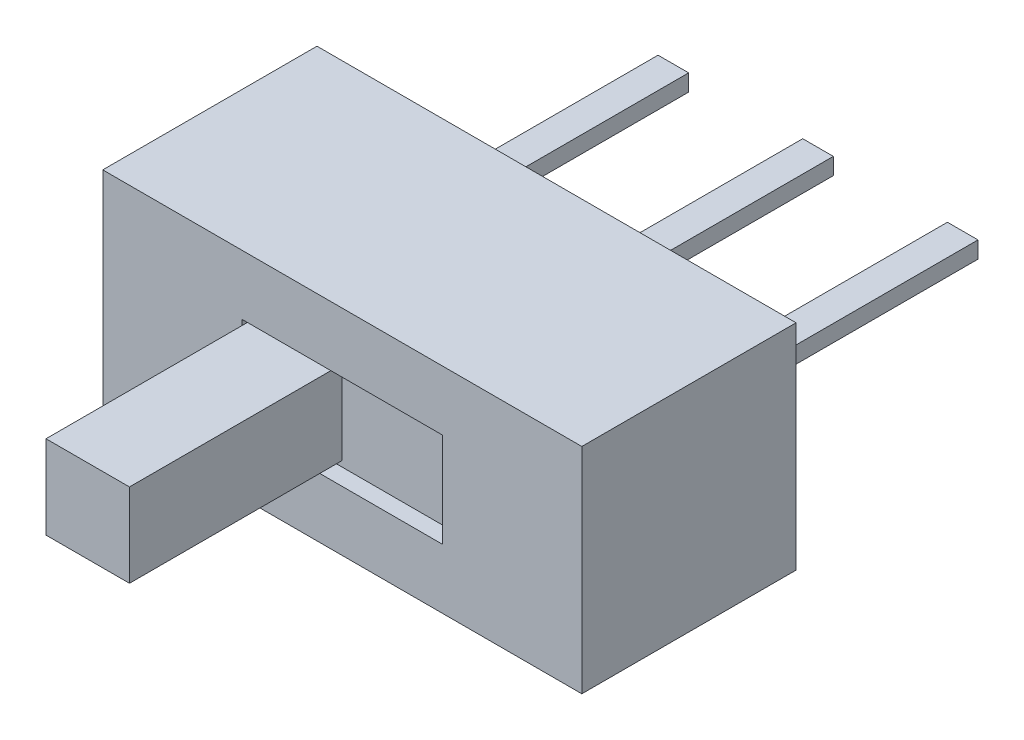
ISO-10303-21;
HEADER;
FILE_DESCRIPTION(('STEP AP214'),'2;1');
FILE_NAME('part.step','',(''),(''),'','','');
FILE_SCHEMA(('AUTOMOTIVE_DESIGN { 1 0 10303 214 1 1 1 1 }'));
ENDSEC;
DATA;
#1=APPLICATION_CONTEXT('core data for automotive mechanical design processes');
#2=APPLICATION_PROTOCOL_DEFINITION('international standard','automotive_design',2000,#1);
#3=PRODUCT_CONTEXT('',#1,'mechanical');
#4=PRODUCT('Part','Part','',(#3));
#5=PRODUCT_RELATED_PRODUCT_CATEGORY('part','',(#4));
#6=PRODUCT_DEFINITION_FORMATION('','',#4);
#7=PRODUCT_DEFINITION_CONTEXT('part definition',#1,'design');
#8=PRODUCT_DEFINITION('design','',#6,#7);
#9=PRODUCT_DEFINITION_SHAPE('','',#8);
#10=(LENGTH_UNIT() NAMED_UNIT(*) SI_UNIT(.MILLI.,.METRE.));
#11=(NAMED_UNIT(*) PLANE_ANGLE_UNIT() SI_UNIT($,.RADIAN.));
#12=(NAMED_UNIT(*) SI_UNIT($,.STERADIAN.) SOLID_ANGLE_UNIT());
#13=UNCERTAINTY_MEASURE_WITH_UNIT(LENGTH_MEASURE(1.E-05),#10,'distance_accuracy_value','');
#14=(GEOMETRIC_REPRESENTATION_CONTEXT(3) GLOBAL_UNCERTAINTY_ASSIGNED_CONTEXT((#13)) GLOBAL_UNIT_ASSIGNED_CONTEXT((#10,
#11,#12)) REPRESENTATION_CONTEXT('',''));
#15=CARTESIAN_POINT('',(0.,0.,0.));
#16=DIRECTION('',(0.,0.,1.));
#17=DIRECTION('',(1.,0.,0.));
#18=AXIS2_PLACEMENT_3D('',#15,#16,#17);
#19=CARTESIAN_POINT('',(-1.805,1.175,1.625));
#20=DIRECTION('',(0.,-1.,0.));
#21=DIRECTION('',(0.,0.,-1.));
#22=AXIS2_PLACEMENT_3D('',#19,#20,#21);
#23=PLANE('',#22);
#24=DIRECTION('',(0.,0.,1.));
#25=VECTOR('',#24,1.);
#26=CARTESIAN_POINT('',(-1.805,1.175,1.625));
#27=LINE('',#26,#25);
#28=CARTESIAN_POINT('',(-1.805,1.175,1.925));
#29=VERTEX_POINT('',#28);
#30=CARTESIAN_POINT('',(-1.805,1.175,5.445));
#31=VERTEX_POINT('',#30);
#32=EDGE_CURVE('E204',#29,#31,#27,.T.);
#33=ORIENTED_EDGE('',*,*,#32,.F.);
#34=DIRECTION('',(0.,0.,-1.));
#35=VECTOR('',#34,1.);
#36=CARTESIAN_POINT('',(-1.805,1.175,1.625));
#37=LINE('',#36,#35);
#38=CARTESIAN_POINT('',(-1.805,1.175,1.625));
#39=VERTEX_POINT('',#38);
#40=EDGE_CURVE('E183',#29,#39,#37,.T.);
#41=ORIENTED_EDGE('',*,*,#40,.T.);
#42=DIRECTION('',(1.,0.,0.));
#43=VECTOR('',#42,1.);
#44=CARTESIAN_POINT('',(-1.805,1.175,1.625));
#45=LINE('',#44,#43);
#46=CARTESIAN_POINT('',(-0.305,1.175,1.625));
#47=VERTEX_POINT('',#46);
#48=EDGE_CURVE('E20',#39,#47,#45,.T.);
#49=ORIENTED_EDGE('',*,*,#48,.T.);
#50=DIRECTION('',(0.,0.,-1.));
#51=VECTOR('',#50,1.);
#52=CARTESIAN_POINT('',(-0.305,1.175,1.625));
#53=LINE('',#52,#51);
#54=CARTESIAN_POINT('',(-0.305,1.175,5.445));
#55=VERTEX_POINT('',#54);
#56=EDGE_CURVE('E219',#55,#47,#53,.T.);
#57=ORIENTED_EDGE('',*,*,#56,.F.);
#58=DIRECTION('',(1.,0.,0.));
#59=VECTOR('',#58,1.);
#60=CARTESIAN_POINT('',(-1.055,1.175,5.445));
#61=LINE('',#60,#59);
#62=EDGE_CURVE('E213',#31,#55,#61,.T.);
#63=ORIENTED_EDGE('',*,*,#62,.F.);
#64=EDGE_LOOP('',(#33,#41,#49,#57,#63));
#65=FACE_BOUND('',#64,.T.);
#66=ADVANCED_FACE('F17',(#65),#23,.T.);
#67=CARTESIAN_POINT('',(-1.805,2.675,1.625));
#68=DIRECTION('',(-1.,0.,0.));
#69=DIRECTION('',(0.,0.,1.));
#70=AXIS2_PLACEMENT_3D('',#67,#68,#69);
#71=PLANE('',#70);
#72=DIRECTION('',(0.,1.,0.));
#73=VECTOR('',#72,1.);
#74=CARTESIAN_POINT('',(-1.805,1.925,5.445));
#75=LINE('',#74,#73);
#76=CARTESIAN_POINT('',(-1.805,2.675,5.445));
#77=VERTEX_POINT('',#76);
#78=EDGE_CURVE('E210',#77,#31,#75,.F.);
#79=ORIENTED_EDGE('',*,*,#78,.F.);
#80=DIRECTION('',(0.,0.,1.));
#81=VECTOR('',#80,1.);
#82=CARTESIAN_POINT('',(-1.805,2.675,1.625));
#83=LINE('',#82,#81);
#84=CARTESIAN_POINT('',(-1.805,2.675,1.925));
#85=VERTEX_POINT('',#84);
#86=EDGE_CURVE('E233',#85,#77,#83,.T.);
#87=ORIENTED_EDGE('',*,*,#86,.F.);
#88=DIRECTION('',(0.,1.,0.));
#89=VECTOR('',#88,1.);
#90=CARTESIAN_POINT('',(-1.805,2.675,1.925));
#91=LINE('',#90,#89);
#92=EDGE_CURVE('E206',#85,#29,#91,.F.);
#93=ORIENTED_EDGE('',*,*,#92,.T.);
#94=ORIENTED_EDGE('',*,*,#32,.T.);
#95=EDGE_LOOP('',(#79,#87,#93,#94));
#96=FACE_BOUND('',#95,.T.);
#97=ADVANCED_FACE('F513',(#96),#71,.T.);
#98=CARTESIAN_POINT('',(-1.055,1.925,5.445));
#99=DIRECTION('',(0.,0.,1.));
#100=DIRECTION('',(1.,0.,0.));
#101=AXIS2_PLACEMENT_3D('',#98,#99,#100);
#102=PLANE('',#101);
#103=ORIENTED_EDGE('',*,*,#62,.T.);
#104=DIRECTION('',(0.,1.,0.));
#105=VECTOR('',#104,1.);
#106=CARTESIAN_POINT('',(-0.305,1.175,5.445));
#107=LINE('',#106,#105);
#108=CARTESIAN_POINT('',(-0.305,2.675,5.445));
#109=VERTEX_POINT('',#108);
#110=EDGE_CURVE('E216',#109,#55,#107,.F.);
#111=ORIENTED_EDGE('',*,*,#110,.F.);
#112=DIRECTION('',(1.,0.,0.));
#113=VECTOR('',#112,1.);
#114=CARTESIAN_POINT('',(-0.305,2.675,5.445));
#115=LINE('',#114,#113);
#116=EDGE_CURVE('E236',#77,#109,#115,.T.);
#117=ORIENTED_EDGE('',*,*,#116,.F.);
#118=ORIENTED_EDGE('',*,*,#78,.T.);
#119=EDGE_LOOP('',(#103,#111,#117,#118));
#120=FACE_BOUND('',#119,.T.);
#121=ADVANCED_FACE('F510',(#120),#102,.T.);
#122=CARTESIAN_POINT('',(-0.305,1.175,1.625));
#123=DIRECTION('',(1.,0.,0.));
#124=DIRECTION('',(0.,0.,-1.));
#125=AXIS2_PLACEMENT_3D('',#122,#123,#124);
#126=PLANE('',#125);
#127=ORIENTED_EDGE('',*,*,#110,.T.);
#128=ORIENTED_EDGE('',*,*,#56,.T.);
#129=DIRECTION('',(0.,1.,0.));
#130=VECTOR('',#129,1.);
#131=CARTESIAN_POINT('',(-0.305,1.175,1.625));
#132=LINE('',#131,#130);
#133=CARTESIAN_POINT('',(-0.305,2.675,1.625));
#134=VERTEX_POINT('',#133);
#135=EDGE_CURVE('E192',#47,#134,#132,.T.);
#136=ORIENTED_EDGE('',*,*,#135,.T.);
#137=DIRECTION('',(0.,0.,1.));
#138=VECTOR('',#137,1.);
#139=CARTESIAN_POINT('',(-0.305,2.675,1.625));
#140=LINE('',#139,#138);
#141=EDGE_CURVE('E239',#109,#134,#140,.F.);
#142=ORIENTED_EDGE('',*,*,#141,.F.);
#143=EDGE_LOOP('',(#127,#128,#136,#142));
#144=FACE_BOUND('',#143,.T.);
#145=ADVANCED_FACE('F506',(#144),#126,.T.);
#146=CARTESIAN_POINT('',(2.875,2.075,-1.925));
#147=DIRECTION('',(1.,0.,0.));
#148=DIRECTION('',(0.,0.,-1.));
#149=AXIS2_PLACEMENT_3D('',#146,#147,#148);
#150=PLANE('',#149);
#151=DIRECTION('',(0.,1.,0.));
#152=VECTOR('',#151,1.);
#153=CARTESIAN_POINT('',(2.875,1.925,-6.625));
#154=LINE('',#153,#152);
#155=CARTESIAN_POINT('',(2.875,2.075,-6.625));
#156=VERTEX_POINT('',#155);
#157=CARTESIAN_POINT('',(2.875,1.775,-6.625));
#158=VERTEX_POINT('',#157);
#159=EDGE_CURVE('E250',#156,#158,#154,.F.);
#160=ORIENTED_EDGE('',*,*,#159,.F.);
#161=DIRECTION('',(0.,0.,1.));
#162=VECTOR('',#161,1.);
#163=CARTESIAN_POINT('',(2.875,2.075,-1.925));
#164=LINE('',#163,#162);
#165=CARTESIAN_POINT('',(2.875,2.075,-1.925));
#166=VERTEX_POINT('',#165);
#167=EDGE_CURVE('E245',#166,#156,#164,.F.);
#168=ORIENTED_EDGE('',*,*,#167,.F.);
#169=DIRECTION('',(0.,1.,0.));
#170=VECTOR('',#169,1.);
#171=CARTESIAN_POINT('',(2.875,2.075,-1.925));
#172=LINE('',#171,#170);
#173=CARTESIAN_POINT('',(2.875,1.775,-1.925));
#174=VERTEX_POINT('',#173);
#175=EDGE_CURVE('E221',#166,#174,#172,.F.);
#176=ORIENTED_EDGE('',*,*,#175,.T.);
#177=DIRECTION('',(0.,0.,-1.));
#178=VECTOR('',#177,1.);
#179=CARTESIAN_POINT('',(2.875,1.775,-1.925));
#180=LINE('',#179,#178);
#181=EDGE_CURVE('E257',#158,#174,#180,.F.);
#182=ORIENTED_EDGE('',*,*,#181,.F.);
#183=EDGE_LOOP('',(#160,#168,#176,#182));
#184=FACE_BOUND('',#183,.T.);
#185=ADVANCED_FACE('F502',(#184),#150,.T.);
#186=CARTESIAN_POINT('',(-2.325,1.775,-1.925));
#187=DIRECTION('',(0.,-1.,0.));
#188=DIRECTION('',(0.,0.,-1.));
#189=AXIS2_PLACEMENT_3D('',#186,#187,#188);
#190=PLANE('',#189);
#191=DIRECTION('',(-1.,0.,0.));
#192=VECTOR('',#191,1.);
#193=CARTESIAN_POINT('',(-2.6,1.775,-6.625));
#194=LINE('',#193,#192);
#195=CARTESIAN_POINT('',(-2.325,1.775,-6.625));
#196=VERTEX_POINT('',#195);
#197=CARTESIAN_POINT('',(-2.875,1.775,-6.625));
#198=VERTEX_POINT('',#197);
#199=EDGE_CURVE('E268',#196,#198,#194,.T.);
#200=ORIENTED_EDGE('',*,*,#199,.F.);
#201=DIRECTION('',(0.,0.,-1.));
#202=VECTOR('',#201,1.);
#203=CARTESIAN_POINT('',(-2.325,1.775,-1.925));
#204=LINE('',#203,#202);
#205=CARTESIAN_POINT('',(-2.325,1.775,-1.925));
#206=VERTEX_POINT('',#205);
#207=EDGE_CURVE('E263',#206,#196,#204,.T.);
#208=ORIENTED_EDGE('',*,*,#207,.F.);
#209=DIRECTION('',(1.,0.,0.));
#210=VECTOR('',#209,1.);
#211=CARTESIAN_POINT('',(-2.325,1.775,-1.925));
#212=LINE('',#211,#210);
#213=CARTESIAN_POINT('',(-2.875,1.775,-1.925));
#214=VERTEX_POINT('',#213);
#215=EDGE_CURVE('E224',#206,#214,#212,.F.);
#216=ORIENTED_EDGE('',*,*,#215,.T.);
#217=DIRECTION('',(0.,0.,1.));
#218=VECTOR('',#217,1.);
#219=CARTESIAN_POINT('',(-2.875,1.775,-1.925));
#220=LINE('',#219,#218);
#221=EDGE_CURVE('E275',#198,#214,#220,.T.);
#222=ORIENTED_EDGE('',*,*,#221,.F.);
#223=EDGE_LOOP('',(#200,#208,#216,#222));
#224=FACE_BOUND('',#223,.T.);
#225=ADVANCED_FACE('F498',(#224),#190,.T.);
#226=CARTESIAN_POINT('',(0.275,1.775,-1.925));
#227=DIRECTION('',(0.,-1.,0.));
#228=DIRECTION('',(0.,0.,-1.));
#229=AXIS2_PLACEMENT_3D('',#226,#227,#228);
#230=PLANE('',#229);
#231=DIRECTION('',(-1.,0.,0.));
#232=VECTOR('',#231,1.);
#233=CARTESIAN_POINT('',(0.,1.775,-6.625));
#234=LINE('',#233,#232);
#235=CARTESIAN_POINT('',(0.275,1.775,-6.625));
#236=VERTEX_POINT('',#235);
#237=CARTESIAN_POINT('',(-0.275,1.775,-6.625));
#238=VERTEX_POINT('',#237);
#239=EDGE_CURVE('E286',#236,#238,#234,.T.);
#240=ORIENTED_EDGE('',*,*,#239,.F.);
#241=DIRECTION('',(0.,0.,-1.));
#242=VECTOR('',#241,1.);
#243=CARTESIAN_POINT('',(0.275,1.775,-1.925));
#244=LINE('',#243,#242);
#245=CARTESIAN_POINT('',(0.275,1.775,-1.925));
#246=VERTEX_POINT('',#245);
#247=EDGE_CURVE('E281',#246,#236,#244,.T.);
#248=ORIENTED_EDGE('',*,*,#247,.F.);
#249=DIRECTION('',(1.,0.,0.));
#250=VECTOR('',#249,1.);
#251=CARTESIAN_POINT('',(0.275,1.775,-1.925));
#252=LINE('',#251,#250);
#253=CARTESIAN_POINT('',(-0.275,1.775,-1.925));
#254=VERTEX_POINT('',#253);
#255=EDGE_CURVE('E227',#246,#254,#252,.F.);
#256=ORIENTED_EDGE('',*,*,#255,.T.);
#257=DIRECTION('',(0.,0.,1.));
#258=VECTOR('',#257,1.);
#259=CARTESIAN_POINT('',(-0.275,1.775,-1.925));
#260=LINE('',#259,#258);
#261=EDGE_CURVE('E293',#238,#254,#260,.T.);
#262=ORIENTED_EDGE('',*,*,#261,.F.);
#263=EDGE_LOOP('',(#240,#248,#256,#262));
#264=FACE_BOUND('',#263,.T.);
#265=ADVANCED_FACE('F494',(#264),#230,.T.);
#266=CARTESIAN_POINT('',(-0.305,2.675,1.625));
#267=DIRECTION('',(0.,1.,0.));
#268=DIRECTION('',(0.,0.,1.));
#269=AXIS2_PLACEMENT_3D('',#266,#267,#268);
#270=PLANE('',#269);
#271=ORIENTED_EDGE('',*,*,#116,.T.);
#272=ORIENTED_EDGE('',*,*,#141,.T.);
#273=DIRECTION('',(-1.,0.,0.));
#274=VECTOR('',#273,1.);
#275=CARTESIAN_POINT('',(0.,2.675,1.625));
#276=LINE('',#275,#274);
#277=CARTESIAN_POINT('',(-1.805,2.675,1.625));
#278=VERTEX_POINT('',#277);
#279=EDGE_CURVE('E199',#134,#278,#276,.T.);
#280=ORIENTED_EDGE('',*,*,#279,.T.);
#281=DIRECTION('',(0.,0.,1.));
#282=VECTOR('',#281,1.);
#283=CARTESIAN_POINT('',(-1.805,2.675,1.625));
#284=LINE('',#283,#282);
#285=EDGE_CURVE('E230',#278,#85,#284,.T.);
#286=ORIENTED_EDGE('',*,*,#285,.T.);
#287=ORIENTED_EDGE('',*,*,#86,.T.);
#288=EDGE_LOOP('',(#271,#272,#280,#286,#287));
#289=FACE_BOUND('',#288,.T.);
#290=ADVANCED_FACE('F490',(#289),#270,.T.);
#291=CARTESIAN_POINT('',(2.325,2.075,-1.925));
#292=DIRECTION('',(0.,1.,0.));
#293=DIRECTION('',(0.,0.,1.));
#294=AXIS2_PLACEMENT_3D('',#291,#292,#293);
#295=PLANE('',#294);
#296=DIRECTION('',(-1.,0.,0.));
#297=VECTOR('',#296,1.);
#298=CARTESIAN_POINT('',(2.6,2.075,-6.625));
#299=LINE('',#298,#297);
#300=CARTESIAN_POINT('',(2.325,2.075,-6.625));
#301=VERTEX_POINT('',#300);
#302=EDGE_CURVE('E247',#301,#156,#299,.F.);
#303=ORIENTED_EDGE('',*,*,#302,.F.);
#304=DIRECTION('',(0.,0.,1.));
#305=VECTOR('',#304,1.);
#306=CARTESIAN_POINT('',(2.325,2.075,-1.925));
#307=LINE('',#306,#305);
#308=CARTESIAN_POINT('',(2.325,2.075,-1.925));
#309=VERTEX_POINT('',#308);
#310=EDGE_CURVE('E299',#309,#301,#307,.F.);
#311=ORIENTED_EDGE('',*,*,#310,.F.);
#312=DIRECTION('',(1.,0.,0.));
#313=VECTOR('',#312,1.);
#314=CARTESIAN_POINT('',(2.325,2.075,-1.925));
#315=LINE('',#314,#313);
#316=EDGE_CURVE('E242',#309,#166,#315,.T.);
#317=ORIENTED_EDGE('',*,*,#316,.T.);
#318=ORIENTED_EDGE('',*,*,#167,.T.);
#319=EDGE_LOOP('',(#303,#311,#317,#318));
#320=FACE_BOUND('',#319,.T.);
#321=ADVANCED_FACE('F486',(#320),#295,.T.);
#322=CARTESIAN_POINT('',(2.6,1.925,-6.625));
#323=DIRECTION('',(0.,0.,-1.));
#324=DIRECTION('',(-1.,0.,0.));
#325=AXIS2_PLACEMENT_3D('',#322,#323,#324);
#326=PLANE('',#325);
#327=ORIENTED_EDGE('',*,*,#159,.T.);
#328=DIRECTION('',(1.,0.,0.));
#329=VECTOR('',#328,1.);
#330=CARTESIAN_POINT('',(2.875,1.775,-6.625));
#331=LINE('',#330,#329);
#332=CARTESIAN_POINT('',(2.325,1.775,-6.625));
#333=VERTEX_POINT('',#332);
#334=EDGE_CURVE('E254',#333,#158,#331,.T.);
#335=ORIENTED_EDGE('',*,*,#334,.F.);
#336=DIRECTION('',(0.,1.,0.));
#337=VECTOR('',#336,1.);
#338=CARTESIAN_POINT('',(2.325,1.775,-6.625));
#339=LINE('',#338,#337);
#340=EDGE_CURVE('E302',#301,#333,#339,.F.);
#341=ORIENTED_EDGE('',*,*,#340,.F.);
#342=ORIENTED_EDGE('',*,*,#302,.T.);
#343=EDGE_LOOP('',(#327,#335,#341,#342));
#344=FACE_BOUND('',#343,.T.);
#345=ADVANCED_FACE('F482',(#344),#326,.T.);
#346=CARTESIAN_POINT('',(2.875,1.775,-1.925));
#347=DIRECTION('',(0.,-1.,0.));
#348=DIRECTION('',(0.,0.,-1.));
#349=AXIS2_PLACEMENT_3D('',#346,#347,#348);
#350=PLANE('',#349);
#351=ORIENTED_EDGE('',*,*,#334,.T.);
#352=ORIENTED_EDGE('',*,*,#181,.T.);
#353=DIRECTION('',(1.,0.,0.));
#354=VECTOR('',#353,1.);
#355=CARTESIAN_POINT('',(2.875,1.775,-1.925));
#356=LINE('',#355,#354);
#357=CARTESIAN_POINT('',(2.325,1.775,-1.925));
#358=VERTEX_POINT('',#357);
#359=EDGE_CURVE('E252',#174,#358,#356,.F.);
#360=ORIENTED_EDGE('',*,*,#359,.T.);
#361=DIRECTION('',(0.,0.,1.));
#362=VECTOR('',#361,1.);
#363=CARTESIAN_POINT('',(2.325,1.775,-1.925));
#364=LINE('',#363,#362);
#365=EDGE_CURVE('E305',#333,#358,#364,.T.);
#366=ORIENTED_EDGE('',*,*,#365,.F.);
#367=EDGE_LOOP('',(#351,#352,#360,#366));
#368=FACE_BOUND('',#367,.T.);
#369=ADVANCED_FACE('F478',(#368),#350,.T.);
#370=CARTESIAN_POINT('',(-2.325,2.075,-1.925));
#371=DIRECTION('',(1.,0.,0.));
#372=DIRECTION('',(0.,0.,-1.));
#373=AXIS2_PLACEMENT_3D('',#370,#371,#372);
#374=PLANE('',#373);
#375=DIRECTION('',(0.,1.,0.));
#376=VECTOR('',#375,1.);
#377=CARTESIAN_POINT('',(-2.325,1.925,-6.625));
#378=LINE('',#377,#376);
#379=CARTESIAN_POINT('',(-2.325,2.075,-6.625));
#380=VERTEX_POINT('',#379);
#381=EDGE_CURVE('E265',#380,#196,#378,.F.);
#382=ORIENTED_EDGE('',*,*,#381,.F.);
#383=DIRECTION('',(0.,0.,1.));
#384=VECTOR('',#383,1.);
#385=CARTESIAN_POINT('',(-2.325,2.075,-1.925));
#386=LINE('',#385,#384);
#387=CARTESIAN_POINT('',(-2.325,2.075,-1.925));
#388=VERTEX_POINT('',#387);
#389=EDGE_CURVE('E308',#388,#380,#386,.F.);
#390=ORIENTED_EDGE('',*,*,#389,.F.);
#391=DIRECTION('',(0.,1.,0.));
#392=VECTOR('',#391,1.);
#393=CARTESIAN_POINT('',(-2.325,2.075,-1.925));
#394=LINE('',#393,#392);
#395=EDGE_CURVE('E260',#388,#206,#394,.F.);
#396=ORIENTED_EDGE('',*,*,#395,.T.);
#397=ORIENTED_EDGE('',*,*,#207,.T.);
#398=EDGE_LOOP('',(#382,#390,#396,#397));
#399=FACE_BOUND('',#398,.T.);
#400=ADVANCED_FACE('F474',(#399),#374,.T.);
#401=CARTESIAN_POINT('',(-2.6,1.925,-6.625));
#402=DIRECTION('',(0.,0.,-1.));
#403=DIRECTION('',(-1.,0.,0.));
#404=AXIS2_PLACEMENT_3D('',#401,#402,#403);
#405=PLANE('',#404);
#406=ORIENTED_EDGE('',*,*,#199,.T.);
#407=DIRECTION('',(0.,1.,0.));
#408=VECTOR('',#407,1.);
#409=CARTESIAN_POINT('',(-2.875,1.775,-6.625));
#410=LINE('',#409,#408);
#411=CARTESIAN_POINT('',(-2.875,2.075,-6.625));
#412=VERTEX_POINT('',#411);
#413=EDGE_CURVE('E272',#412,#198,#410,.F.);
#414=ORIENTED_EDGE('',*,*,#413,.F.);
#415=DIRECTION('',(1.,0.,0.));
#416=VECTOR('',#415,1.);
#417=CARTESIAN_POINT('',(-2.875,2.075,-6.625));
#418=LINE('',#417,#416);
#419=EDGE_CURVE('E311',#380,#412,#418,.F.);
#420=ORIENTED_EDGE('',*,*,#419,.F.);
#421=ORIENTED_EDGE('',*,*,#381,.T.);
#422=EDGE_LOOP('',(#406,#414,#420,#421));
#423=FACE_BOUND('',#422,.T.);
#424=ADVANCED_FACE('F470',(#423),#405,.T.);
#425=CARTESIAN_POINT('',(-2.875,1.775,-1.925));
#426=DIRECTION('',(-1.,0.,0.));
#427=DIRECTION('',(0.,0.,1.));
#428=AXIS2_PLACEMENT_3D('',#425,#426,#427);
#429=PLANE('',#428);
#430=ORIENTED_EDGE('',*,*,#413,.T.);
#431=ORIENTED_EDGE('',*,*,#221,.T.);
#432=DIRECTION('',(0.,1.,0.));
#433=VECTOR('',#432,1.);
#434=CARTESIAN_POINT('',(-2.875,1.775,-1.925));
#435=LINE('',#434,#433);
#436=CARTESIAN_POINT('',(-2.875,2.075,-1.925));
#437=VERTEX_POINT('',#436);
#438=EDGE_CURVE('E270',#214,#437,#435,.T.);
#439=ORIENTED_EDGE('',*,*,#438,.T.);
#440=DIRECTION('',(0.,0.,1.));
#441=VECTOR('',#440,1.);
#442=CARTESIAN_POINT('',(-2.875,2.075,-1.925));
#443=LINE('',#442,#441);
#444=EDGE_CURVE('E314',#412,#437,#443,.T.);
#445=ORIENTED_EDGE('',*,*,#444,.F.);
#446=EDGE_LOOP('',(#430,#431,#439,#445));
#447=FACE_BOUND('',#446,.T.);
#448=ADVANCED_FACE('F466',(#447),#429,.T.);
#449=CARTESIAN_POINT('',(0.275,2.075,-1.925));
#450=DIRECTION('',(1.,0.,0.));
#451=DIRECTION('',(0.,0.,-1.));
#452=AXIS2_PLACEMENT_3D('',#449,#450,#451);
#453=PLANE('',#452);
#454=DIRECTION('',(0.,1.,0.));
#455=VECTOR('',#454,1.);
#456=CARTESIAN_POINT('',(0.275,1.925,-6.625));
#457=LINE('',#456,#455);
#458=CARTESIAN_POINT('',(0.275,2.075,-6.625));
#459=VERTEX_POINT('',#458);
#460=EDGE_CURVE('E283',#459,#236,#457,.F.);
#461=ORIENTED_EDGE('',*,*,#460,.F.);
#462=DIRECTION('',(0.,0.,1.));
#463=VECTOR('',#462,1.);
#464=CARTESIAN_POINT('',(0.275,2.075,-1.925));
#465=LINE('',#464,#463);
#466=CARTESIAN_POINT('',(0.275,2.075,-1.925));
#467=VERTEX_POINT('',#466);
#468=EDGE_CURVE('E317',#467,#459,#465,.F.);
#469=ORIENTED_EDGE('',*,*,#468,.F.);
#470=DIRECTION('',(0.,1.,0.));
#471=VECTOR('',#470,1.);
#472=CARTESIAN_POINT('',(0.275,2.075,-1.925));
#473=LINE('',#472,#471);
#474=EDGE_CURVE('E278',#467,#246,#473,.F.);
#475=ORIENTED_EDGE('',*,*,#474,.T.);
#476=ORIENTED_EDGE('',*,*,#247,.T.);
#477=EDGE_LOOP('',(#461,#469,#475,#476));
#478=FACE_BOUND('',#477,.T.);
#479=ADVANCED_FACE('F462',(#478),#453,.T.);
#480=CARTESIAN_POINT('',(0.,1.925,-6.625));
#481=DIRECTION('',(0.,0.,-1.));
#482=DIRECTION('',(-1.,0.,0.));
#483=AXIS2_PLACEMENT_3D('',#480,#481,#482);
#484=PLANE('',#483);
#485=ORIENTED_EDGE('',*,*,#239,.T.);
#486=DIRECTION('',(0.,1.,0.));
#487=VECTOR('',#486,1.);
#488=CARTESIAN_POINT('',(-0.275,1.775,-6.625));
#489=LINE('',#488,#487);
#490=CARTESIAN_POINT('',(-0.275,2.075,-6.625));
#491=VERTEX_POINT('',#490);
#492=EDGE_CURVE('E290',#491,#238,#489,.F.);
#493=ORIENTED_EDGE('',*,*,#492,.F.);
#494=DIRECTION('',(1.,0.,0.));
#495=VECTOR('',#494,1.);
#496=CARTESIAN_POINT('',(-0.275,2.075,-6.625));
#497=LINE('',#496,#495);
#498=EDGE_CURVE('E320',#459,#491,#497,.F.);
#499=ORIENTED_EDGE('',*,*,#498,.F.);
#500=ORIENTED_EDGE('',*,*,#460,.T.);
#501=EDGE_LOOP('',(#485,#493,#499,#500));
#502=FACE_BOUND('',#501,.T.);
#503=ADVANCED_FACE('F458',(#502),#484,.T.);
#504=CARTESIAN_POINT('',(-0.275,1.775,-1.925));
#505=DIRECTION('',(-1.,0.,0.));
#506=DIRECTION('',(0.,0.,1.));
#507=AXIS2_PLACEMENT_3D('',#504,#505,#506);
#508=PLANE('',#507);
#509=ORIENTED_EDGE('',*,*,#492,.T.);
#510=ORIENTED_EDGE('',*,*,#261,.T.);
#511=DIRECTION('',(0.,1.,0.));
#512=VECTOR('',#511,1.);
#513=CARTESIAN_POINT('',(-0.275,1.775,-1.925));
#514=LINE('',#513,#512);
#515=CARTESIAN_POINT('',(-0.275,2.075,-1.925));
#516=VERTEX_POINT('',#515);
#517=EDGE_CURVE('E288',#254,#516,#514,.T.);
#518=ORIENTED_EDGE('',*,*,#517,.T.);
#519=DIRECTION('',(0.,0.,1.));
#520=VECTOR('',#519,1.);
#521=CARTESIAN_POINT('',(-0.275,2.075,-1.925));
#522=LINE('',#521,#520);
#523=EDGE_CURVE('E323',#491,#516,#522,.T.);
#524=ORIENTED_EDGE('',*,*,#523,.F.);
#525=EDGE_LOOP('',(#509,#510,#518,#524));
#526=FACE_BOUND('',#525,.T.);
#527=ADVANCED_FACE('F455',(#526),#508,.T.);
#528=CARTESIAN_POINT('',(0.,1.925,1.625));
#529=DIRECTION('',(0.,0.,-1.));
#530=DIRECTION('',(-1.,0.,0.));
#531=AXIS2_PLACEMENT_3D('',#528,#529,#530);
#532=PLANE('',#531);
#533=ORIENTED_EDGE('',*,*,#135,.F.);
#534=ORIENTED_EDGE('',*,*,#48,.F.);
#535=DIRECTION('',(0.,1.,0.));
#536=VECTOR('',#535,1.);
#537=CARTESIAN_POINT('',(-1.805,1.925,1.625));
#538=LINE('',#537,#536);
#539=CARTESIAN_POINT('',(-1.805,1.075,1.625));
#540=VERTEX_POINT('',#539);
#541=EDGE_CURVE('E189',#540,#39,#538,.T.);
#542=ORIENTED_EDGE('',*,*,#541,.F.);
#543=DIRECTION('',(1.,0.,0.));
#544=VECTOR('',#543,1.);
#545=CARTESIAN_POINT('',(1.805,1.075,1.625));
#546=LINE('',#545,#544);
#547=CARTESIAN_POINT('',(1.805,1.075,1.625));
#548=VERTEX_POINT('',#547);
#549=EDGE_CURVE('E333',#540,#548,#546,.T.);
#550=ORIENTED_EDGE('',*,*,#549,.T.);
#551=DIRECTION('',(0.,1.,0.));
#552=VECTOR('',#551,1.);
#553=CARTESIAN_POINT('',(1.805,2.775,1.625));
#554=LINE('',#553,#552);
#555=CARTESIAN_POINT('',(1.805,2.775,1.625));
#556=VERTEX_POINT('',#555);
#557=EDGE_CURVE('E329',#548,#556,#554,.T.);
#558=ORIENTED_EDGE('',*,*,#557,.T.);
#559=DIRECTION('',(1.,0.,0.));
#560=VECTOR('',#559,1.);
#561=CARTESIAN_POINT('',(-1.805,2.775,1.625));
#562=LINE('',#561,#560);
#563=CARTESIAN_POINT('',(-1.805,2.775,1.625));
#564=VERTEX_POINT('',#563);
#565=EDGE_CURVE('E326',#556,#564,#562,.F.);
#566=ORIENTED_EDGE('',*,*,#565,.T.);
#567=DIRECTION('',(0.,1.,0.));
#568=VECTOR('',#567,1.);
#569=CARTESIAN_POINT('',(-1.805,1.925,1.625));
#570=LINE('',#569,#568);
#571=EDGE_CURVE('E200',#278,#564,#570,.T.);
#572=ORIENTED_EDGE('',*,*,#571,.F.);
#573=ORIENTED_EDGE('',*,*,#279,.F.);
#574=EDGE_LOOP('',(#533,#534,#542,#550,#558,#566,#572,#573));
#575=FACE_BOUND('',#574,.T.);
#576=ADVANCED_FACE('F188',(#575),#532,.F.);
#577=CARTESIAN_POINT('',(2.325,1.775,-1.925));
#578=DIRECTION('',(-1.,0.,0.));
#579=DIRECTION('',(0.,0.,1.));
#580=AXIS2_PLACEMENT_3D('',#577,#578,#579);
#581=PLANE('',#580);
#582=ORIENTED_EDGE('',*,*,#340,.T.);
#583=ORIENTED_EDGE('',*,*,#365,.T.);
#584=DIRECTION('',(0.,1.,0.));
#585=VECTOR('',#584,1.);
#586=CARTESIAN_POINT('',(2.325,0.,-1.925));
#587=LINE('',#586,#585);
#588=EDGE_CURVE('E344',#309,#358,#587,.F.);
#589=ORIENTED_EDGE('',*,*,#588,.F.);
#590=ORIENTED_EDGE('',*,*,#310,.T.);
#591=EDGE_LOOP('',(#582,#583,#589,#590));
#592=FACE_BOUND('',#591,.T.);
#593=ADVANCED_FACE('F448',(#592),#581,.T.);
#594=CARTESIAN_POINT('',(-2.875,2.075,-1.925));
#595=DIRECTION('',(0.,1.,0.));
#596=DIRECTION('',(0.,0.,1.));
#597=AXIS2_PLACEMENT_3D('',#594,#595,#596);
#598=PLANE('',#597);
#599=ORIENTED_EDGE('',*,*,#419,.T.);
#600=ORIENTED_EDGE('',*,*,#444,.T.);
#601=DIRECTION('',(-1.,0.,0.));
#602=VECTOR('',#601,1.);
#603=CARTESIAN_POINT('',(4.305,2.075,-1.925));
#604=LINE('',#603,#602);
#605=EDGE_CURVE('E347',#388,#437,#604,.T.);
#606=ORIENTED_EDGE('',*,*,#605,.F.);
#607=ORIENTED_EDGE('',*,*,#389,.T.);
#608=EDGE_LOOP('',(#599,#600,#606,#607));
#609=FACE_BOUND('',#608,.T.);
#610=ADVANCED_FACE('F444',(#609),#598,.T.);
#611=CARTESIAN_POINT('',(-0.275,2.075,-1.925));
#612=DIRECTION('',(0.,1.,0.));
#613=DIRECTION('',(0.,0.,1.));
#614=AXIS2_PLACEMENT_3D('',#611,#612,#613);
#615=PLANE('',#614);
#616=ORIENTED_EDGE('',*,*,#498,.T.);
#617=ORIENTED_EDGE('',*,*,#523,.T.);
#618=DIRECTION('',(-1.,0.,0.));
#619=VECTOR('',#618,1.);
#620=CARTESIAN_POINT('',(4.305,2.075,-1.925));
#621=LINE('',#620,#619);
#622=EDGE_CURVE('E350',#467,#516,#621,.T.);
#623=ORIENTED_EDGE('',*,*,#622,.F.);
#624=ORIENTED_EDGE('',*,*,#468,.T.);
#625=EDGE_LOOP('',(#616,#617,#623,#624));
#626=FACE_BOUND('',#625,.T.);
#627=ADVANCED_FACE('F440',(#626),#615,.T.);
#628=CARTESIAN_POINT('',(-1.805,2.775,1.925));
#629=DIRECTION('',(0.,1.,0.));
#630=DIRECTION('',(0.,0.,1.));
#631=AXIS2_PLACEMENT_3D('',#628,#629,#630);
#632=PLANE('',#631);
#633=DIRECTION('',(0.,0.,1.));
#634=VECTOR('',#633,1.);
#635=CARTESIAN_POINT('',(-1.805,2.775,1.925));
#636=LINE('',#635,#634);
#637=CARTESIAN_POINT('',(-1.805,2.775,1.925));
#638=VERTEX_POINT('',#637);
#639=EDGE_CURVE('E338',#638,#564,#636,.F.);
#640=ORIENTED_EDGE('',*,*,#639,.T.);
#641=ORIENTED_EDGE('',*,*,#565,.F.);
#642=DIRECTION('',(0.,0.,-1.));
#643=VECTOR('',#642,1.);
#644=CARTESIAN_POINT('',(1.805,2.775,1.925));
#645=LINE('',#644,#643);
#646=CARTESIAN_POINT('',(1.805,2.775,1.925));
#647=VERTEX_POINT('',#646);
#648=EDGE_CURVE('E331',#556,#647,#645,.F.);
#649=ORIENTED_EDGE('',*,*,#648,.T.);
#650=DIRECTION('',(1.,0.,0.));
#651=VECTOR('',#650,1.);
#652=CARTESIAN_POINT('',(-4.305,2.775,1.925));
#653=LINE('',#652,#651);
#654=EDGE_CURVE('E364',#638,#647,#653,.T.);
#655=ORIENTED_EDGE('',*,*,#654,.F.);
#656=EDGE_LOOP('',(#640,#641,#649,#655));
#657=FACE_BOUND('',#656,.T.);
#658=ADVANCED_FACE('F436',(#657),#632,.F.);
#659=CARTESIAN_POINT('',(1.805,2.775,1.925));
#660=DIRECTION('',(1.,0.,0.));
#661=DIRECTION('',(0.,0.,-1.));
#662=AXIS2_PLACEMENT_3D('',#659,#660,#661);
#663=PLANE('',#662);
#664=ORIENTED_EDGE('',*,*,#648,.F.);
#665=ORIENTED_EDGE('',*,*,#557,.F.);
#666=DIRECTION('',(0.,0.,-1.));
#667=VECTOR('',#666,1.);
#668=CARTESIAN_POINT('',(1.805,1.075,1.925));
#669=LINE('',#668,#667);
#670=CARTESIAN_POINT('',(1.805,1.075,1.925));
#671=VERTEX_POINT('',#670);
#672=EDGE_CURVE('E335',#548,#671,#669,.F.);
#673=ORIENTED_EDGE('',*,*,#672,.T.);
#674=DIRECTION('',(0.,1.,0.));
#675=VECTOR('',#674,1.);
#676=CARTESIAN_POINT('',(1.805,0.,1.925));
#677=LINE('',#676,#675);
#678=EDGE_CURVE('E367',#647,#671,#677,.F.);
#679=ORIENTED_EDGE('',*,*,#678,.F.);
#680=EDGE_LOOP('',(#664,#665,#673,#679));
#681=FACE_BOUND('',#680,.T.);
#682=ADVANCED_FACE('F432',(#681),#663,.F.);
#683=CARTESIAN_POINT('',(1.805,1.075,1.925));
#684=DIRECTION('',(0.,-1.,0.));
#685=DIRECTION('',(0.,0.,-1.));
#686=AXIS2_PLACEMENT_3D('',#683,#684,#685);
#687=PLANE('',#686);
#688=ORIENTED_EDGE('',*,*,#672,.F.);
#689=ORIENTED_EDGE('',*,*,#549,.F.);
#690=DIRECTION('',(0.,0.,1.));
#691=VECTOR('',#690,1.);
#692=CARTESIAN_POINT('',(-1.805,1.075,1.925));
#693=LINE('',#692,#691);
#694=CARTESIAN_POINT('',(-1.805,1.075,1.925));
#695=VERTEX_POINT('',#694);
#696=EDGE_CURVE('E198',#540,#695,#693,.T.);
#697=ORIENTED_EDGE('',*,*,#696,.T.);
#698=DIRECTION('',(1.,0.,0.));
#699=VECTOR('',#698,1.);
#700=CARTESIAN_POINT('',(-4.305,1.075,1.925));
#701=LINE('',#700,#699);
#702=EDGE_CURVE('E370',#671,#695,#701,.F.);
#703=ORIENTED_EDGE('',*,*,#702,.F.);
#704=EDGE_LOOP('',(#688,#689,#697,#703));
#705=FACE_BOUND('',#704,.T.);
#706=ADVANCED_FACE('F429',(#705),#687,.F.);
#707=CARTESIAN_POINT('',(-1.805,1.075,1.925));
#708=DIRECTION('',(-1.,0.,0.));
#709=DIRECTION('',(0.,0.,1.));
#710=AXIS2_PLACEMENT_3D('',#707,#708,#709);
#711=PLANE('',#710);
#712=DIRECTION('',(0.,1.,0.));
#713=VECTOR('',#712,1.);
#714=CARTESIAN_POINT('',(-1.805,0.,1.925));
#715=LINE('',#714,#713);
#716=EDGE_CURVE('E373',#695,#29,#715,.T.);
#717=ORIENTED_EDGE('',*,*,#716,.F.);
#718=ORIENTED_EDGE('',*,*,#696,.F.);
#719=ORIENTED_EDGE('',*,*,#541,.T.);
#720=ORIENTED_EDGE('',*,*,#40,.F.);
#721=EDGE_LOOP('',(#717,#718,#719,#720));
#722=FACE_BOUND('',#721,.T.);
#723=ADVANCED_FACE('F197',(#722),#711,.F.);
#724=CARTESIAN_POINT('',(-1.805,1.075,1.925));
#725=DIRECTION('',(-1.,0.,0.));
#726=DIRECTION('',(0.,0.,1.));
#727=AXIS2_PLACEMENT_3D('',#724,#725,#726);
#728=PLANE('',#727);
#729=ORIENTED_EDGE('',*,*,#571,.T.);
#730=ORIENTED_EDGE('',*,*,#639,.F.);
#731=DIRECTION('',(0.,1.,0.));
#732=VECTOR('',#731,1.);
#733=CARTESIAN_POINT('',(-1.805,0.,1.925));
#734=LINE('',#733,#732);
#735=EDGE_CURVE('E375',#85,#638,#734,.T.);
#736=ORIENTED_EDGE('',*,*,#735,.F.);
#737=ORIENTED_EDGE('',*,*,#285,.F.);
#738=EDGE_LOOP('',(#729,#730,#736,#737));
#739=FACE_BOUND('',#738,.T.);
#740=ADVANCED_FACE('F423',(#739),#728,.F.);
#741=CARTESIAN_POINT('',(0.,0.,0.));
#742=DIRECTION('',(0.,1.,0.));
#743=DIRECTION('',(0.,0.,1.));
#744=AXIS2_PLACEMENT_3D('',#741,#742,#743);
#745=PLANE('',#744);
#746=DIRECTION('',(0.,0.,-1.));
#747=VECTOR('',#746,1.);
#748=CARTESIAN_POINT('',(4.305,0.,1.925));
#749=LINE('',#748,#747);
#750=CARTESIAN_POINT('',(4.305,0.,1.925));
#751=VERTEX_POINT('',#750);
#752=CARTESIAN_POINT('',(4.305,0.,-1.925));
#753=VERTEX_POINT('',#752);
#754=EDGE_CURVE('E378',#751,#753,#749,.T.);
#755=ORIENTED_EDGE('',*,*,#754,.F.);
#756=DIRECTION('',(1.,0.,0.));
#757=VECTOR('',#756,1.);
#758=CARTESIAN_POINT('',(-4.305,0.,1.925));
#759=LINE('',#758,#757);
#760=CARTESIAN_POINT('',(-4.305,0.,1.925));
#761=VERTEX_POINT('',#760);
#762=EDGE_CURVE('E359',#761,#751,#759,.T.);
#763=ORIENTED_EDGE('',*,*,#762,.F.);
#764=DIRECTION('',(0.,0.,1.));
#765=VECTOR('',#764,1.);
#766=CARTESIAN_POINT('',(-4.305,0.,-1.925));
#767=LINE('',#766,#765);
#768=CARTESIAN_POINT('',(-4.305,0.,-1.925));
#769=VERTEX_POINT('',#768);
#770=EDGE_CURVE('E353',#769,#761,#767,.T.);
#771=ORIENTED_EDGE('',*,*,#770,.F.);
#772=DIRECTION('',(-1.,0.,0.));
#773=VECTOR('',#772,1.);
#774=CARTESIAN_POINT('',(4.305,0.,-1.925));
#775=LINE('',#774,#773);
#776=EDGE_CURVE('E341',#753,#769,#775,.T.);
#777=ORIENTED_EDGE('',*,*,#776,.F.);
#778=EDGE_LOOP('',(#755,#763,#771,#777));
#779=FACE_BOUND('',#778,.T.);
#780=ADVANCED_FACE('F399',(#779),#745,.F.);
#781=CARTESIAN_POINT('',(4.305,0.,-1.925));
#782=DIRECTION('',(0.,0.,-1.));
#783=DIRECTION('',(-1.,0.,0.));
#784=AXIS2_PLACEMENT_3D('',#781,#782,#783);
#785=PLANE('',#784);
#786=ORIENTED_EDGE('',*,*,#474,.F.);
#787=ORIENTED_EDGE('',*,*,#622,.T.);
#788=ORIENTED_EDGE('',*,*,#517,.F.);
#789=ORIENTED_EDGE('',*,*,#255,.F.);
#790=EDGE_LOOP('',(#786,#787,#788,#789));
#791=FACE_BOUND('',#790,.T.);
#792=ORIENTED_EDGE('',*,*,#395,.F.);
#793=ORIENTED_EDGE('',*,*,#605,.T.);
#794=ORIENTED_EDGE('',*,*,#438,.F.);
#795=ORIENTED_EDGE('',*,*,#215,.F.);
#796=EDGE_LOOP('',(#792,#793,#794,#795));
#797=FACE_BOUND('',#796,.T.);
#798=ORIENTED_EDGE('',*,*,#316,.F.);
#799=ORIENTED_EDGE('',*,*,#588,.T.);
#800=ORIENTED_EDGE('',*,*,#359,.F.);
#801=ORIENTED_EDGE('',*,*,#175,.F.);
#802=EDGE_LOOP('',(#798,#799,#800,#801));
#803=FACE_BOUND('',#802,.T.);
#804=DIRECTION('',(1.,0.,0.));
#805=VECTOR('',#804,1.);
#806=CARTESIAN_POINT('',(0.,3.85,-1.925));
#807=LINE('',#806,#805);
#808=CARTESIAN_POINT('',(4.305,3.85,-1.925));
#809=VERTEX_POINT('',#808);
#810=CARTESIAN_POINT('',(-4.305,3.85,-1.925));
#811=VERTEX_POINT('',#810);
#812=EDGE_CURVE('E385',#809,#811,#807,.F.);
#813=ORIENTED_EDGE('',*,*,#812,.F.);
#814=DIRECTION('',(0.,1.,0.));
#815=VECTOR('',#814,1.);
#816=CARTESIAN_POINT('',(4.305,0.,-1.925));
#817=LINE('',#816,#815);
#818=EDGE_CURVE('E381',#753,#809,#817,.T.);
#819=ORIENTED_EDGE('',*,*,#818,.F.);
#820=ORIENTED_EDGE('',*,*,#776,.T.);
#821=DIRECTION('',(0.,1.,0.));
#822=VECTOR('',#821,1.);
#823=CARTESIAN_POINT('',(-4.305,0.,-1.925));
#824=LINE('',#823,#822);
#825=EDGE_CURVE('E356',#811,#769,#824,.F.);
#826=ORIENTED_EDGE('',*,*,#825,.F.);
#827=EDGE_LOOP('',(#813,#819,#820,#826));
#828=FACE_BOUND('',#827,.T.);
#829=ADVANCED_FACE('F402',(#791,#797,#803,#828),#785,.T.);
#830=CARTESIAN_POINT('',(-4.305,0.,-1.925));
#831=DIRECTION('',(-1.,0.,0.));
#832=DIRECTION('',(0.,0.,1.));
#833=AXIS2_PLACEMENT_3D('',#830,#831,#832);
#834=PLANE('',#833);
#835=DIRECTION('',(0.,0.,1.));
#836=VECTOR('',#835,1.);
#837=CARTESIAN_POINT('',(-4.305,3.85,0.));
#838=LINE('',#837,#836);
#839=CARTESIAN_POINT('',(-4.305,3.85,1.925));
#840=VERTEX_POINT('',#839);
#841=EDGE_CURVE('E388',#811,#840,#838,.T.);
#842=ORIENTED_EDGE('',*,*,#841,.F.);
#843=ORIENTED_EDGE('',*,*,#825,.T.);
#844=ORIENTED_EDGE('',*,*,#770,.T.);
#845=DIRECTION('',(0.,1.,0.));
#846=VECTOR('',#845,1.);
#847=CARTESIAN_POINT('',(-4.305,0.,1.925));
#848=LINE('',#847,#846);
#849=EDGE_CURVE('E361',#840,#761,#848,.F.);
#850=ORIENTED_EDGE('',*,*,#849,.F.);
#851=EDGE_LOOP('',(#842,#843,#844,#850));
#852=FACE_BOUND('',#851,.T.);
#853=ADVANCED_FACE('F397',(#852),#834,.T.);
#854=CARTESIAN_POINT('',(-4.305,0.,1.925));
#855=DIRECTION('',(0.,0.,1.));
#856=DIRECTION('',(1.,0.,0.));
#857=AXIS2_PLACEMENT_3D('',#854,#855,#856);
#858=PLANE('',#857);
#859=ORIENTED_EDGE('',*,*,#92,.F.);
#860=ORIENTED_EDGE('',*,*,#735,.T.);
#861=ORIENTED_EDGE('',*,*,#654,.T.);
#862=ORIENTED_EDGE('',*,*,#678,.T.);
#863=ORIENTED_EDGE('',*,*,#702,.T.);
#864=ORIENTED_EDGE('',*,*,#716,.T.);
#865=EDGE_LOOP('',(#859,#860,#861,#862,#863,#864));
#866=FACE_BOUND('',#865,.T.);
#867=DIRECTION('',(1.,0.,0.));
#868=VECTOR('',#867,1.);
#869=CARTESIAN_POINT('',(0.,3.85,1.925));
#870=LINE('',#869,#868);
#871=CARTESIAN_POINT('',(4.305,3.85,1.925));
#872=VERTEX_POINT('',#871);
#873=EDGE_CURVE('E26',#840,#872,#870,.T.);
#874=ORIENTED_EDGE('',*,*,#873,.F.);
#875=ORIENTED_EDGE('',*,*,#849,.T.);
#876=ORIENTED_EDGE('',*,*,#762,.T.);
#877=DIRECTION('',(0.,1.,0.));
#878=VECTOR('',#877,1.);
#879=CARTESIAN_POINT('',(4.305,0.,1.925));
#880=LINE('',#879,#878);
#881=EDGE_CURVE('E35',#872,#751,#880,.F.);
#882=ORIENTED_EDGE('',*,*,#881,.F.);
#883=EDGE_LOOP('',(#874,#875,#876,#882));
#884=FACE_BOUND('',#883,.T.);
#885=ADVANCED_FACE('F395',(#866,#884),#858,.T.);
#886=CARTESIAN_POINT('',(4.305,0.,1.925));
#887=DIRECTION('',(1.,0.,0.));
#888=DIRECTION('',(0.,0.,-1.));
#889=AXIS2_PLACEMENT_3D('',#886,#887,#888);
#890=PLANE('',#889);
#891=DIRECTION('',(0.,0.,1.));
#892=VECTOR('',#891,1.);
#893=CARTESIAN_POINT('',(4.305,3.85,0.));
#894=LINE('',#893,#892);
#895=EDGE_CURVE('E11',#872,#809,#894,.F.);
#896=ORIENTED_EDGE('',*,*,#895,.F.);
#897=ORIENTED_EDGE('',*,*,#881,.T.);
#898=ORIENTED_EDGE('',*,*,#754,.T.);
#899=ORIENTED_EDGE('',*,*,#818,.T.);
#900=EDGE_LOOP('',(#896,#897,#898,#899));
#901=FACE_BOUND('',#900,.T.);
#902=ADVANCED_FACE('F404',(#901),#890,.T.);
#903=CARTESIAN_POINT('',(0.,3.85,0.));
#904=DIRECTION('',(0.,1.,0.));
#905=DIRECTION('',(0.,0.,1.));
#906=AXIS2_PLACEMENT_3D('',#903,#904,#905);
#907=PLANE('',#906);
#908=ORIENTED_EDGE('',*,*,#873,.T.);
#909=ORIENTED_EDGE('',*,*,#895,.T.);
#910=ORIENTED_EDGE('',*,*,#812,.T.);
#911=ORIENTED_EDGE('',*,*,#841,.T.);
#912=EDGE_LOOP('',(#908,#909,#910,#911));
#913=FACE_BOUND('',#912,.T.);
#914=ADVANCED_FACE('F393',(#913),#907,.T.);
#915=CLOSED_SHELL('',(#66,#97,#121,#145,#185,#225,#265,#290,#321,#345,#369,#400,#424,#448,#479,
#503,#527,#576,#593,#610,#627,#658,#682,#706,#723,#740,#780,#829,#853,#885,#902,#914));
#916=MANIFOLD_SOLID_BREP('B1',#915);
#917=ADVANCED_BREP_SHAPE_REPRESENTATION('',(#18,#916),#14);
#918=SHAPE_DEFINITION_REPRESENTATION(#9,#917);
ENDSEC;
END-ISO-10303-21;
